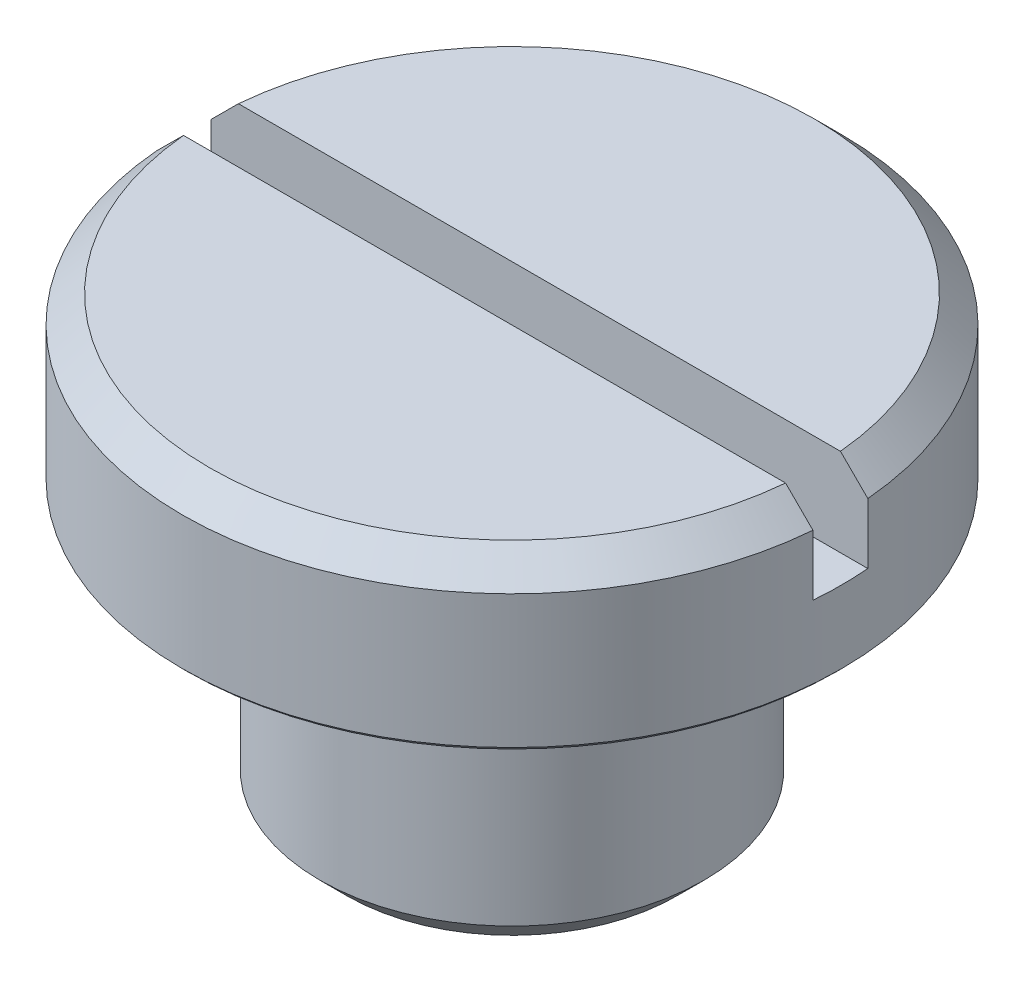
ISO-10303-21;
HEADER;
FILE_DESCRIPTION(('STEP AP214'),'2;1');
FILE_NAME('part.step','',(''),(''),'','','');
FILE_SCHEMA(('AUTOMOTIVE_DESIGN { 1 0 10303 214 1 1 1 1 }'));
ENDSEC;
DATA;
#1=APPLICATION_CONTEXT('core data for automotive mechanical design processes');
#2=APPLICATION_PROTOCOL_DEFINITION('international standard','automotive_design',2000,#1);
#3=PRODUCT_CONTEXT('',#1,'mechanical');
#4=PRODUCT('Part','Part','',(#3));
#5=PRODUCT_RELATED_PRODUCT_CATEGORY('part','',(#4));
#6=PRODUCT_DEFINITION_FORMATION('','',#4);
#7=PRODUCT_DEFINITION_CONTEXT('part definition',#1,'design');
#8=PRODUCT_DEFINITION('design','',#6,#7);
#9=PRODUCT_DEFINITION_SHAPE('','',#8);
#10=(LENGTH_UNIT() NAMED_UNIT(*) SI_UNIT(.MILLI.,.METRE.));
#11=(NAMED_UNIT(*) PLANE_ANGLE_UNIT() SI_UNIT($,.RADIAN.));
#12=(NAMED_UNIT(*) SI_UNIT($,.STERADIAN.) SOLID_ANGLE_UNIT());
#13=UNCERTAINTY_MEASURE_WITH_UNIT(LENGTH_MEASURE(1.E-05),#10,'distance_accuracy_value','');
#14=(GEOMETRIC_REPRESENTATION_CONTEXT(3) GLOBAL_UNCERTAINTY_ASSIGNED_CONTEXT((#13)) GLOBAL_UNIT_ASSIGNED_CONTEXT((#10,
#11,#12)) REPRESENTATION_CONTEXT('',''));
#15=CARTESIAN_POINT('',(0.,0.,0.));
#16=DIRECTION('',(0.,0.,1.));
#17=DIRECTION('',(1.,0.,0.));
#18=AXIS2_PLACEMENT_3D('',#15,#16,#17);
#19=CARTESIAN_POINT('',(0.,0.,-5.55625));
#20=DIRECTION('',(0.,-1.,0.));
#21=DIRECTION('',(0.,0.,-1.));
#22=AXIS2_PLACEMENT_3D('',#19,#20,#21);
#23=PLANE('',#22);
#24=CARTESIAN_POINT('',(0.,5.68433104405908E-11,0.));
#25=DIRECTION('',(0.,1.,0.));
#26=DIRECTION('',(0.,0.,1.));
#27=AXIS2_PLACEMENT_3D('',#24,#25,#26);
#28=CIRCLE('',#27,4.76885000000493);
#29=CARTESIAN_POINT('',(0.,5.68433104405908E-11,4.76885000000493));
#30=VERTEX_POINT('',#29);
#31=EDGE_CURVE('E372',#30,#30,#28,.T.);
#32=ORIENTED_EDGE('',*,*,#31,.F.);
#33=EDGE_LOOP('',(#32));
#34=FACE_BOUND('',#33,.T.);
#35=ADVANCED_FACE('F16',(#34),#23,.T.);
#36=CARTESIAN_POINT('',(0.,0.787399999978788,0.));
#37=DIRECTION('',(0.,1.,0.));
#38=DIRECTION('',(0.,0.,1.));
#39=AXIS2_PLACEMENT_3D('',#36,#37,#38);
#40=CONICAL_SURFACE('',#39,5.55624999998372,0.785398163433544);
#41=ORIENTED_EDGE('',*,*,#31,.T.);
#42=EDGE_LOOP('',(#41));
#43=FACE_BOUND('',#42,.T.);
#44=CARTESIAN_POINT('',(0.,0.787400000000008,0.));
#45=DIRECTION('',(0.,-1.,0.));
#46=DIRECTION('',(0.,0.,-1.));
#47=AXIS2_PLACEMENT_3D('',#44,#45,#46);
#48=CIRCLE('',#47,5.55625);
#49=CARTESIAN_POINT('',(0.,0.787400000000008,-5.55625));
#50=VERTEX_POINT('',#49);
#51=EDGE_CURVE('E369',#50,#50,#48,.F.);
#52=ORIENTED_EDGE('',*,*,#51,.F.);
#53=EDGE_LOOP('',(#52));
#54=FACE_BOUND('',#53,.T.);
#55=ADVANCED_FACE('F595',(#43,#54),#40,.T.);
#56=CARTESIAN_POINT('',(0.,0.,0.));
#57=DIRECTION('',(0.,-1.,0.));
#58=DIRECTION('',(0.,0.,-1.));
#59=AXIS2_PLACEMENT_3D('',#56,#57,#58);
#60=CYLINDRICAL_SURFACE('',#59,5.55625);
#61=CARTESIAN_POINT('',(0.,6.35,0.));
#62=DIRECTION('',(0.,-1.,0.));
#63=DIRECTION('',(0.,0.,-1.));
#64=AXIS2_PLACEMENT_3D('',#61,#62,#63);
#65=CIRCLE('',#64,5.55625);
#66=CARTESIAN_POINT('',(0.,6.35,-5.55625));
#67=VERTEX_POINT('',#66);
#68=EDGE_CURVE('E361',#67,#67,#65,.T.);
#69=ORIENTED_EDGE('',*,*,#68,.T.);
#70=EDGE_LOOP('',(#69));
#71=FACE_BOUND('',#70,.T.);
#72=ORIENTED_EDGE('',*,*,#51,.T.);
#73=EDGE_LOOP('',(#72));
#74=FACE_BOUND('',#73,.T.);
#75=ADVANCED_FACE('F355',(#71,#74),#60,.T.);
#76=CARTESIAN_POINT('',(0.,7.14375,0.));
#77=DIRECTION('',(0.,-1.,0.));
#78=DIRECTION('',(0.,0.,-1.));
#79=AXIS2_PLACEMENT_3D('',#76,#77,#78);
#80=TOROIDAL_SURFACE('',#79,5.55625,0.793750000000001);
#81=ORIENTED_EDGE('',*,*,#68,.F.);
#82=EDGE_LOOP('',(#81));
#83=FACE_BOUND('',#82,.T.);
#84=CARTESIAN_POINT('',(0.,7.9375,0.));
#85=DIRECTION('',(0.,-1.,0.));
#86=DIRECTION('',(0.,0.,1.));
#87=AXIS2_PLACEMENT_3D('',#84,#85,#86);
#88=CIRCLE('',#87,5.55625);
#89=CARTESIAN_POINT('',(0.,7.9375,-5.55625));
#90=VERTEX_POINT('',#89);
#91=CARTESIAN_POINT('',(0.,7.9375,5.55625));
#92=VERTEX_POINT('',#91);
#93=EDGE_CURVE('E331',#90,#92,#88,.F.);
#94=ORIENTED_EDGE('',*,*,#93,.F.);
#95=CARTESIAN_POINT('',(0.,7.9375,0.));
#96=DIRECTION('',(0.,-1.,0.));
#97=DIRECTION('',(0.,0.,-1.));
#98=AXIS2_PLACEMENT_3D('',#95,#96,#97);
#99=CIRCLE('',#98,5.55625);
#100=EDGE_CURVE('E321',#92,#90,#99,.F.);
#101=ORIENTED_EDGE('',*,*,#100,.F.);
#102=EDGE_LOOP('',(#94,#101));
#103=FACE_BOUND('',#102,.T.);
#104=ADVANCED_FACE('F351',(#83,#103),#80,.F.);
#105=CARTESIAN_POINT('',(0.,7.9375,-6.604));
#106=DIRECTION('',(0.,-1.,0.));
#107=DIRECTION('',(0.,0.,-1.));
#108=AXIS2_PLACEMENT_3D('',#105,#106,#107);
#109=PLANE('',#108);
#110=ORIENTED_EDGE('',*,*,#100,.T.);
#111=ORIENTED_EDGE('',*,*,#93,.T.);
#112=EDGE_LOOP('',(#110,#111));
#113=FACE_BOUND('',#112,.T.);
#114=CARTESIAN_POINT('',(0.,7.9375,0.));
#115=DIRECTION('',(0.,1.,0.));
#116=DIRECTION('',(0.,0.,1.));
#117=AXIS2_PLACEMENT_3D('',#114,#115,#116);
#118=CIRCLE('',#117,6.477);
#119=CARTESIAN_POINT('',(0.,7.9375,6.477));
#120=VERTEX_POINT('',#119);
#121=CARTESIAN_POINT('',(0.,7.9375,-6.477));
#122=VERTEX_POINT('',#121);
#123=EDGE_CURVE('E299',#120,#122,#118,.T.);
#124=ORIENTED_EDGE('',*,*,#123,.F.);
#125=CARTESIAN_POINT('',(0.,7.9375,0.));
#126=DIRECTION('',(0.,1.,0.));
#127=DIRECTION('',(0.,0.,-1.));
#128=AXIS2_PLACEMENT_3D('',#125,#126,#127);
#129=CIRCLE('',#128,6.477);
#130=EDGE_CURVE('E275',#122,#120,#129,.T.);
#131=ORIENTED_EDGE('',*,*,#130,.F.);
#132=EDGE_LOOP('',(#124,#131));
#133=FACE_BOUND('',#132,.T.);
#134=ADVANCED_FACE('F289',(#113,#133),#109,.T.);
#135=CARTESIAN_POINT('',(0.,8.0645,0.));
#136=DIRECTION('',(0.,-1.,0.));
#137=DIRECTION('',(0.,0.,-1.));
#138=AXIS2_PLACEMENT_3D('',#135,#136,#137);
#139=TOROIDAL_SURFACE('',#138,6.477,0.127);
#140=ORIENTED_EDGE('',*,*,#130,.T.);
#141=ORIENTED_EDGE('',*,*,#123,.T.);
#142=EDGE_LOOP('',(#140,#141));
#143=FACE_BOUND('',#142,.T.);
#144=CARTESIAN_POINT('',(0.,8.0645,0.));
#145=DIRECTION('',(0.,-1.,0.));
#146=DIRECTION('',(0.,0.,-1.));
#147=AXIS2_PLACEMENT_3D('',#144,#145,#146);
#148=CIRCLE('',#147,6.604);
#149=CARTESIAN_POINT('',(0.,8.0645,-6.604));
#150=VERTEX_POINT('',#149);
#151=EDGE_CURVE('E296',#150,#150,#148,.F.);
#152=ORIENTED_EDGE('',*,*,#151,.F.);
#153=EDGE_LOOP('',(#152));
#154=FACE_BOUND('',#153,.T.);
#155=ADVANCED_FACE('F279',(#143,#154),#139,.T.);
#156=CARTESIAN_POINT('',(0.,0.,0.));
#157=DIRECTION('',(0.,-1.,0.));
#158=DIRECTION('',(0.,0.,-1.));
#159=AXIS2_PLACEMENT_3D('',#156,#157,#158);
#160=CYLINDRICAL_SURFACE('',#159,6.604);
#161=ORIENTED_EDGE('',*,*,#151,.T.);
#162=EDGE_LOOP('',(#161));
#163=FACE_BOUND('',#162,.T.);
#164=CARTESIAN_POINT('',(0.,8.8265,0.));
#165=DIRECTION('',(0.,-1.,0.));
#166=DIRECTION('',(0.,0.,-1.));
#167=AXIS2_PLACEMENT_3D('',#164,#165,#166);
#168=CIRCLE('',#167,6.604);
#169=CARTESIAN_POINT('',(0.,8.8265,-6.604));
#170=VERTEX_POINT('',#169);
#171=EDGE_CURVE('E638',#170,#170,#168,.T.);
#172=ORIENTED_EDGE('',*,*,#171,.T.);
#173=EDGE_LOOP('',(#172));
#174=FACE_BOUND('',#173,.T.);
#175=ADVANCED_FACE('F257',(#163,#174),#160,.T.);
#176=CARTESIAN_POINT('',(0.,8.8265,0.));
#177=DIRECTION('',(0.,-1.,0.));
#178=DIRECTION('',(0.,0.,-1.));
#179=AXIS2_PLACEMENT_3D('',#176,#177,#178);
#180=TOROIDAL_SURFACE('',#179,6.985,0.381);
#181=ORIENTED_EDGE('',*,*,#171,.F.);
#182=EDGE_LOOP('',(#181));
#183=FACE_BOUND('',#182,.T.);
#184=CARTESIAN_POINT('',(0.,9.2075,0.));
#185=DIRECTION('',(0.,-1.,0.));
#186=DIRECTION('',(0.,0.,1.));
#187=AXIS2_PLACEMENT_3D('',#184,#185,#186);
#188=CIRCLE('',#187,6.985);
#189=CARTESIAN_POINT('',(0.,9.2075,-6.985));
#190=VERTEX_POINT('',#189);
#191=CARTESIAN_POINT('',(0.,9.2075,6.985));
#192=VERTEX_POINT('',#191);
#193=EDGE_CURVE('E203',#190,#192,#188,.F.);
#194=ORIENTED_EDGE('',*,*,#193,.F.);
#195=CARTESIAN_POINT('',(0.,9.2075,0.));
#196=DIRECTION('',(0.,-1.,0.));
#197=DIRECTION('',(0.,0.,-1.));
#198=AXIS2_PLACEMENT_3D('',#195,#196,#197);
#199=CIRCLE('',#198,6.985);
#200=EDGE_CURVE('E213',#192,#190,#199,.F.);
#201=ORIENTED_EDGE('',*,*,#200,.F.);
#202=EDGE_LOOP('',(#194,#201));
#203=FACE_BOUND('',#202,.T.);
#204=ADVANCED_FACE('F253',(#183,#203),#180,.F.);
#205=CARTESIAN_POINT('',(0.,9.2075,-8.763));
#206=DIRECTION('',(0.,-1.,0.));
#207=DIRECTION('',(0.,0.,-1.));
#208=AXIS2_PLACEMENT_3D('',#205,#206,#207);
#209=PLANE('',#208);
#210=CARTESIAN_POINT('',(0.,9.2075,0.));
#211=DIRECTION('',(0.,1.,0.));
#212=DIRECTION('',(0.,0.,1.));
#213=AXIS2_PLACEMENT_3D('',#210,#211,#212);
#214=CIRCLE('',#213,8.382);
#215=CARTESIAN_POINT('',(0.,9.2075,-8.382));
#216=VERTEX_POINT('',#215);
#217=CARTESIAN_POINT('',(0.,9.2075,8.382));
#218=VERTEX_POINT('',#217);
#219=EDGE_CURVE('E224',#216,#218,#214,.F.);
#220=ORIENTED_EDGE('',*,*,#219,.T.);
#221=CARTESIAN_POINT('',(0.,9.2075,0.));
#222=DIRECTION('',(0.,1.,0.));
#223=DIRECTION('',(0.,0.,-1.));
#224=AXIS2_PLACEMENT_3D('',#221,#222,#223);
#225=CIRCLE('',#224,8.382);
#226=EDGE_CURVE('E175',#218,#216,#225,.F.);
#227=ORIENTED_EDGE('',*,*,#226,.T.);
#228=EDGE_LOOP('',(#220,#227));
#229=FACE_BOUND('',#228,.T.);
#230=ORIENTED_EDGE('',*,*,#193,.T.);
#231=ORIENTED_EDGE('',*,*,#200,.T.);
#232=EDGE_LOOP('',(#230,#231));
#233=FACE_BOUND('',#232,.T.);
#234=ADVANCED_FACE('F190',(#229,#233),#209,.T.);
#235=CARTESIAN_POINT('',(0.,8.8265,0.));
#236=DIRECTION('',(0.,-1.,0.));
#237=DIRECTION('',(0.,0.,-1.));
#238=AXIS2_PLACEMENT_3D('',#235,#236,#237);
#239=TOROIDAL_SURFACE('',#238,8.382,0.381);
#240=ORIENTED_EDGE('',*,*,#219,.F.);
#241=ORIENTED_EDGE('',*,*,#226,.F.);
#242=EDGE_LOOP('',(#240,#241));
#243=FACE_BOUND('',#242,.T.);
#244=CARTESIAN_POINT('',(0.,8.8265,0.));
#245=DIRECTION('',(0.,-1.,0.));
#246=DIRECTION('',(0.,0.,-1.));
#247=AXIS2_PLACEMENT_3D('',#244,#245,#246);
#248=CIRCLE('',#247,8.763);
#249=CARTESIAN_POINT('',(0.,8.8265,-8.763));
#250=VERTEX_POINT('',#249);
#251=EDGE_CURVE('E198',#250,#250,#248,.T.);
#252=ORIENTED_EDGE('',*,*,#251,.T.);
#253=EDGE_LOOP('',(#252));
#254=FACE_BOUND('',#253,.T.);
#255=ADVANCED_FACE('F180',(#243,#254),#239,.F.);
#256=CARTESIAN_POINT('',(0.,0.,0.));
#257=DIRECTION('',(0.,-1.,0.));
#258=DIRECTION('',(0.,0.,-1.));
#259=AXIS2_PLACEMENT_3D('',#256,#257,#258);
#260=CYLINDRICAL_SURFACE('',#259,8.763);
#261=ORIENTED_EDGE('',*,*,#251,.F.);
#262=EDGE_LOOP('',(#261));
#263=FACE_BOUND('',#262,.T.);
#264=CARTESIAN_POINT('',(0.,8.0645,0.));
#265=DIRECTION('',(0.,-1.,0.));
#266=DIRECTION('',(0.,0.,-1.));
#267=AXIS2_PLACEMENT_3D('',#264,#265,#266);
#268=CIRCLE('',#267,8.763);
#269=CARTESIAN_POINT('',(0.,8.0645,-8.763));
#270=VERTEX_POINT('',#269);
#271=EDGE_CURVE('E124',#270,#270,#268,.F.);
#272=ORIENTED_EDGE('',*,*,#271,.F.);
#273=EDGE_LOOP('',(#272));
#274=FACE_BOUND('',#273,.T.);
#275=ADVANCED_FACE('F155',(#263,#274),#260,.F.);
#276=CARTESIAN_POINT('',(0.,8.0645,0.));
#277=DIRECTION('',(0.,-1.,0.));
#278=DIRECTION('',(0.,0.,-1.));
#279=AXIS2_PLACEMENT_3D('',#276,#277,#278);
#280=TOROIDAL_SURFACE('',#279,8.89,0.127);
#281=ORIENTED_EDGE('',*,*,#271,.T.);
#282=EDGE_LOOP('',(#281));
#283=FACE_BOUND('',#282,.T.);
#284=CARTESIAN_POINT('',(0.,7.9375,0.));
#285=DIRECTION('',(0.,-1.,0.));
#286=DIRECTION('',(0.,0.,-1.));
#287=AXIS2_PLACEMENT_3D('',#284,#285,#286);
#288=CIRCLE('',#287,8.89);
#289=CARTESIAN_POINT('',(0.,7.9375,8.89));
#290=VERTEX_POINT('',#289);
#291=CARTESIAN_POINT('',(0.,7.9375,-8.89));
#292=VERTEX_POINT('',#291);
#293=EDGE_CURVE('E120',#290,#292,#288,.F.);
#294=ORIENTED_EDGE('',*,*,#293,.F.);
#295=CARTESIAN_POINT('',(0.,7.9375,0.));
#296=DIRECTION('',(0.,-1.,0.));
#297=DIRECTION('',(0.,0.,1.));
#298=AXIS2_PLACEMENT_3D('',#295,#296,#297);
#299=CIRCLE('',#298,8.89);
#300=EDGE_CURVE('E116',#292,#290,#299,.F.);
#301=ORIENTED_EDGE('',*,*,#300,.F.);
#302=EDGE_LOOP('',(#294,#301));
#303=FACE_BOUND('',#302,.T.);
#304=ADVANCED_FACE('F119',(#283,#303),#280,.T.);
#305=CARTESIAN_POINT('',(0.,7.9375,-9.525));
#306=DIRECTION('',(0.,-1.,0.));
#307=DIRECTION('',(0.,0.,-1.));
#308=AXIS2_PLACEMENT_3D('',#305,#306,#307);
#309=PLANE('',#308);
#310=ORIENTED_EDGE('',*,*,#300,.T.);
#311=ORIENTED_EDGE('',*,*,#293,.T.);
#312=EDGE_LOOP('',(#310,#311));
#313=FACE_BOUND('',#312,.T.);
#314=CARTESIAN_POINT('',(0.,7.9375,0.));
#315=DIRECTION('',(0.,1.,0.));
#316=DIRECTION('',(0.,0.,1.));
#317=AXIS2_PLACEMENT_3D('',#314,#315,#316);
#318=CIRCLE('',#317,9.39800000000001);
#319=CARTESIAN_POINT('',(0.,7.9375,9.39800000000001));
#320=VERTEX_POINT('',#319);
#321=EDGE_CURVE('E466',#320,#320,#318,.T.);
#322=ORIENTED_EDGE('',*,*,#321,.F.);
#323=EDGE_LOOP('',(#322));
#324=FACE_BOUND('',#323,.T.);
#325=ADVANCED_FACE('F128',(#313,#324),#309,.T.);
#326=CARTESIAN_POINT('',(0.,12.7,0.));
#327=DIRECTION('',(0.,1.,0.));
#328=DIRECTION('',(0.,0.,1.));
#329=AXIS2_PLACEMENT_3D('',#326,#327,#328);
#330=PLANE('',#329);
#331=CARTESIAN_POINT('',(0.,12.7,0.));
#332=DIRECTION('',(0.,-1.,0.));
#333=DIRECTION('',(1.,0.,0.));
#334=AXIS2_PLACEMENT_3D('',#331,#332,#333);
#335=CIRCLE('',#334,8.73759999999999);
#336=CARTESIAN_POINT('',(-8.70147198452652,12.7,-0.79375));
#337=VERTEX_POINT('',#336);
#338=CARTESIAN_POINT('',(8.70147198452652,12.7,-0.79375));
#339=VERTEX_POINT('',#338);
#340=EDGE_CURVE('E441',#337,#339,#335,.T.);
#341=ORIENTED_EDGE('',*,*,#340,.F.);
#342=DIRECTION('',(-1.,0.,0.));
#343=VECTOR('',#342,1.);
#344=CARTESIAN_POINT('',(-11.6601748807631,12.7,-0.79375));
#345=LINE('',#344,#343);
#346=EDGE_CURVE('E80',#337,#339,#345,.F.);
#347=ORIENTED_EDGE('',*,*,#346,.T.);
#348=EDGE_LOOP('',(#341,#347));
#349=FACE_BOUND('',#348,.T.);
#350=ADVANCED_FACE('F149',(#349),#330,.T.);
#351=CARTESIAN_POINT('',(-11.6601748807631,10.16,0.79375));
#352=DIRECTION('',(0.,1.,0.));
#353=DIRECTION('',(0.,0.,1.));
#354=AXIS2_PLACEMENT_3D('',#351,#352,#353);
#355=PLANE('',#354);
#356=DIRECTION('',(-1.,0.,0.));
#357=VECTOR('',#356,1.);
#358=CARTESIAN_POINT('',(-11.6601748807631,10.16,-0.79375));
#359=LINE('',#358,#357);
#360=CARTESIAN_POINT('',(9.49186946483674,10.16,-0.79375));
#361=VERTEX_POINT('',#360);
#362=CARTESIAN_POINT('',(-9.49186946483674,10.16,-0.79375));
#363=VERTEX_POINT('',#362);
#364=EDGE_CURVE('E59',#361,#363,#359,.T.);
#365=ORIENTED_EDGE('',*,*,#364,.T.);
#366=CARTESIAN_POINT('',(0.,10.16,0.));
#367=DIRECTION('',(0.,-1.,0.));
#368=DIRECTION('',(0.,0.,-1.));
#369=AXIS2_PLACEMENT_3D('',#366,#367,#368);
#370=CIRCLE('',#369,9.525);
#371=CARTESIAN_POINT('',(-9.49186946483674,10.16,0.79375));
#372=VERTEX_POINT('',#371);
#373=EDGE_CURVE('E75',#372,#363,#370,.T.);
#374=ORIENTED_EDGE('',*,*,#373,.F.);
#375=DIRECTION('',(1.,0.,0.));
#376=VECTOR('',#375,1.);
#377=CARTESIAN_POINT('',(-11.6601748807631,10.16,0.79375));
#378=LINE('',#377,#376);
#379=CARTESIAN_POINT('',(9.49186946483674,10.16,0.79375));
#380=VERTEX_POINT('',#379);
#381=EDGE_CURVE('E432',#372,#380,#378,.T.);
#382=ORIENTED_EDGE('',*,*,#381,.T.);
#383=CARTESIAN_POINT('',(0.,10.16,0.));
#384=DIRECTION('',(0.,-1.,0.));
#385=DIRECTION('',(0.,0.,-1.));
#386=AXIS2_PLACEMENT_3D('',#383,#384,#385);
#387=CIRCLE('',#386,9.525);
#388=EDGE_CURVE('E35',#380,#361,#387,.F.);
#389=ORIENTED_EDGE('',*,*,#388,.T.);
#390=EDGE_LOOP('',(#365,#374,#382,#389));
#391=FACE_BOUND('',#390,.T.);
#392=ADVANCED_FACE('F405',(#391),#355,.T.);
#393=CARTESIAN_POINT('',(0.,12.7,0.));
#394=DIRECTION('',(0.,1.,0.));
#395=DIRECTION('',(0.,0.,1.));
#396=AXIS2_PLACEMENT_3D('',#393,#394,#395);
#397=PLANE('',#396);
#398=DIRECTION('',(1.,0.,0.));
#399=VECTOR('',#398,1.);
#400=CARTESIAN_POINT('',(-11.6601748807631,12.7,0.79375));
#401=LINE('',#400,#399);
#402=CARTESIAN_POINT('',(8.70147198452652,12.7,0.79375));
#403=VERTEX_POINT('',#402);
#404=CARTESIAN_POINT('',(-8.70147198452652,12.7,0.79375));
#405=VERTEX_POINT('',#404);
#406=EDGE_CURVE('E383',#403,#405,#401,.F.);
#407=ORIENTED_EDGE('',*,*,#406,.T.);
#408=CARTESIAN_POINT('',(0.,12.7,0.));
#409=DIRECTION('',(0.,-1.,0.));
#410=DIRECTION('',(1.,0.,0.));
#411=AXIS2_PLACEMENT_3D('',#408,#409,#410);
#412=CIRCLE('',#411,8.73759999999999);
#413=EDGE_CURVE('E72',#403,#405,#412,.T.);
#414=ORIENTED_EDGE('',*,*,#413,.F.);
#415=EDGE_LOOP('',(#407,#414));
#416=FACE_BOUND('',#415,.T.);
#417=ADVANCED_FACE('F400',(#416),#397,.T.);
#418=CARTESIAN_POINT('',(0.,11.9126,0.));
#419=DIRECTION('',(0.,-1.,0.));
#420=DIRECTION('',(1.,0.,0.));
#421=AXIS2_PLACEMENT_3D('',#418,#419,#420);
#422=CONICAL_SURFACE('',#421,9.525,0.785398163397453);
#423=CARTESIAN_POINT('',(9.49186946483674,11.9126,0.79375));
#424=CARTESIAN_POINT('',(9.36015813194599,12.0438549959036,0.79375));
#425=CARTESIAN_POINT('',(9.22843600882729,12.175099160503,0.79375));
#426=CARTESIAN_POINT('',(8.96497018205723,12.4375658271696,0.79375));
#427=CARTESIAN_POINT('',(8.83322647840585,12.568788329237,0.79375));
#428=CARTESIAN_POINT('',(8.70147198452652,12.7,0.79375));
#429=B_SPLINE_CURVE_WITH_KNOTS('',3,(#423,#424,#425,#426,#427,#428),.UNSPECIFIED.,.F.,.F.,(4,2,
4),(0.,0.557836657223684,1.11567331477257),.UNSPECIFIED.);
#430=CARTESIAN_POINT('',(9.49186946483674,11.9126,0.79375));
#431=VERTEX_POINT('',#430);
#432=EDGE_CURVE('E384',#431,#403,#429,.T.);
#433=ORIENTED_EDGE('',*,*,#432,.T.);
#434=ORIENTED_EDGE('',*,*,#413,.T.);
#435=CARTESIAN_POINT('',(-8.70147198452652,12.7,0.79375));
#436=CARTESIAN_POINT('',(-8.83322647840585,12.568788329237,0.79375));
#437=CARTESIAN_POINT('',(-8.96497018205723,12.4375658271696,0.79375));
#438=CARTESIAN_POINT('',(-9.22843600882729,12.175099160503,0.79375));
#439=CARTESIAN_POINT('',(-9.36015813194599,12.0438549959036,0.79375));
#440=CARTESIAN_POINT('',(-9.49186946483674,11.9126,0.79375));
#441=B_SPLINE_CURVE_WITH_KNOTS('',3,(#435,#436,#437,#438,#439,#440),.UNSPECIFIED.,.F.,.F.,(4,2,
4),(0.,0.557836657548883,1.11567331477257),.UNSPECIFIED.);
#442=CARTESIAN_POINT('',(-9.49186946483674,11.9126,0.79375));
#443=VERTEX_POINT('',#442);
#444=EDGE_CURVE('E373',#405,#443,#441,.T.);
#445=ORIENTED_EDGE('',*,*,#444,.T.);
#446=CARTESIAN_POINT('',(0.,11.9126,0.));
#447=DIRECTION('',(0.,-1.,0.));
#448=DIRECTION('',(0.,0.,-1.));
#449=AXIS2_PLACEMENT_3D('',#446,#447,#448);
#450=CIRCLE('',#449,9.525);
#451=EDGE_CURVE('E423',#431,#443,#450,.T.);
#452=ORIENTED_EDGE('',*,*,#451,.F.);
#453=EDGE_LOOP('',(#433,#434,#445,#452));
#454=FACE_BOUND('',#453,.T.);
#455=ADVANCED_FACE('F394',(#454),#422,.T.);
#456=CARTESIAN_POINT('',(0.,8.06449999999999,0.));
#457=DIRECTION('',(0.,1.,0.));
#458=DIRECTION('',(0.,0.,1.));
#459=AXIS2_PLACEMENT_3D('',#456,#457,#458);
#460=CONICAL_SURFACE('',#459,9.525,0.785398163397448);
#461=CARTESIAN_POINT('',(0.,8.06449999999999,0.));
#462=DIRECTION('',(0.,-1.,0.));
#463=DIRECTION('',(0.,0.,-1.));
#464=AXIS2_PLACEMENT_3D('',#461,#462,#463);
#465=CIRCLE('',#464,9.525);
#466=CARTESIAN_POINT('',(0.,8.06449999999999,-9.525));
#467=VERTEX_POINT('',#466);
#468=EDGE_CURVE('E421',#467,#467,#465,.F.);
#469=ORIENTED_EDGE('',*,*,#468,.F.);
#470=EDGE_LOOP('',(#469));
#471=FACE_BOUND('',#470,.T.);
#472=ORIENTED_EDGE('',*,*,#321,.T.);
#473=EDGE_LOOP('',(#472));
#474=FACE_BOUND('',#473,.T.);
#475=ADVANCED_FACE('F399',(#471,#474),#460,.T.);
#476=CARTESIAN_POINT('',(0.,11.9126,0.));
#477=DIRECTION('',(0.,-1.,0.));
#478=DIRECTION('',(1.,0.,0.));
#479=AXIS2_PLACEMENT_3D('',#476,#477,#478);
#480=CONICAL_SURFACE('',#479,9.525,0.785398163397453);
#481=CARTESIAN_POINT('',(8.70147198452652,12.7,-0.79375));
#482=CARTESIAN_POINT('',(8.83322647840585,12.568788329237,-0.79375));
#483=CARTESIAN_POINT('',(8.96497018205723,12.4375658271696,-0.79375));
#484=CARTESIAN_POINT('',(9.22843600882729,12.175099160503,-0.79375));
#485=CARTESIAN_POINT('',(9.36015813194598,12.0438549959036,-0.79375));
#486=CARTESIAN_POINT('',(9.49186946483674,11.9126,-0.79375));
#487=B_SPLINE_CURVE_WITH_KNOTS('',3,(#481,#482,#483,#484,#485,#486),.UNSPECIFIED.,.F.,.F.,(4,2,
4),(0.,0.557836657548882,1.11567331477257),.UNSPECIFIED.);
#488=CARTESIAN_POINT('',(9.49186946483674,11.9126,-0.79375));
#489=VERTEX_POINT('',#488);
#490=EDGE_CURVE('E434',#339,#489,#487,.T.);
#491=ORIENTED_EDGE('',*,*,#490,.T.);
#492=CARTESIAN_POINT('',(0.,11.9126,0.));
#493=DIRECTION('',(0.,-1.,0.));
#494=DIRECTION('',(0.,0.,-1.));
#495=AXIS2_PLACEMENT_3D('',#492,#493,#494);
#496=CIRCLE('',#495,9.525);
#497=CARTESIAN_POINT('',(-9.49186946483674,11.9126,-0.79375));
#498=VERTEX_POINT('',#497);
#499=EDGE_CURVE('E49',#498,#489,#496,.T.);
#500=ORIENTED_EDGE('',*,*,#499,.F.);
#501=CARTESIAN_POINT('',(-9.49186946483674,11.9126,-0.79375));
#502=CARTESIAN_POINT('',(-9.36015813194599,12.0438549959036,-0.79375));
#503=CARTESIAN_POINT('',(-9.22843600882729,12.175099160503,-0.79375));
#504=CARTESIAN_POINT('',(-8.96497018205723,12.4375658271696,-0.79375));
#505=CARTESIAN_POINT('',(-8.83322647840585,12.568788329237,-0.79375));
#506=CARTESIAN_POINT('',(-8.70147198452652,12.7,-0.79375));
#507=B_SPLINE_CURVE_WITH_KNOTS('',3,(#501,#502,#503,#504,#505,#506),.UNSPECIFIED.,.F.,.F.,(4,2,
4),(0.,0.557836657223685,1.11567331477257),.UNSPECIFIED.);
#508=EDGE_CURVE('E130',#498,#337,#507,.T.);
#509=ORIENTED_EDGE('',*,*,#508,.T.);
#510=ORIENTED_EDGE('',*,*,#340,.T.);
#511=EDGE_LOOP('',(#491,#500,#509,#510));
#512=FACE_BOUND('',#511,.T.);
#513=ADVANCED_FACE('F455',(#512),#480,.T.);
#514=CARTESIAN_POINT('',(-11.6601748807631,10.16,-0.79375));
#515=DIRECTION('',(0.,0.,-1.));
#516=DIRECTION('',(-1.,0.,0.));
#517=AXIS2_PLACEMENT_3D('',#514,#515,#516);
#518=PLANE('',#517);
#519=ORIENTED_EDGE('',*,*,#490,.F.);
#520=ORIENTED_EDGE('',*,*,#346,.F.);
#521=ORIENTED_EDGE('',*,*,#508,.F.);
#522=DIRECTION('',(0.,1.,0.));
#523=VECTOR('',#522,1.);
#524=CARTESIAN_POINT('',(-9.49186946483674,10.16,-0.79375));
#525=LINE('',#524,#523);
#526=EDGE_CURVE('E436',#363,#498,#525,.T.);
#527=ORIENTED_EDGE('',*,*,#526,.F.);
#528=ORIENTED_EDGE('',*,*,#364,.F.);
#529=DIRECTION('',(0.,-1.,0.));
#530=VECTOR('',#529,1.);
#531=CARTESIAN_POINT('',(9.49186946483674,0.,-0.793750000000001));
#532=LINE('',#531,#530);
#533=EDGE_CURVE('E27',#489,#361,#532,.T.);
#534=ORIENTED_EDGE('',*,*,#533,.F.);
#535=EDGE_LOOP('',(#519,#520,#521,#527,#528,#534));
#536=FACE_BOUND('',#535,.T.);
#537=ADVANCED_FACE('F417',(#536),#518,.F.);
#538=CARTESIAN_POINT('',(-11.6601748807631,10.16,0.79375));
#539=DIRECTION('',(0.,0.,1.));
#540=DIRECTION('',(1.,0.,0.));
#541=AXIS2_PLACEMENT_3D('',#538,#539,#540);
#542=PLANE('',#541);
#543=ORIENTED_EDGE('',*,*,#444,.F.);
#544=ORIENTED_EDGE('',*,*,#406,.F.);
#545=ORIENTED_EDGE('',*,*,#432,.F.);
#546=DIRECTION('',(0.,-1.,0.));
#547=VECTOR('',#546,1.);
#548=CARTESIAN_POINT('',(9.49186946483674,0.,0.79375));
#549=LINE('',#548,#547);
#550=EDGE_CURVE('E11',#380,#431,#549,.F.);
#551=ORIENTED_EDGE('',*,*,#550,.F.);
#552=ORIENTED_EDGE('',*,*,#381,.F.);
#553=DIRECTION('',(0.,1.,0.));
#554=VECTOR('',#553,1.);
#555=CARTESIAN_POINT('',(-9.49186946483674,10.16,0.79375));
#556=LINE('',#555,#554);
#557=EDGE_CURVE('E382',#443,#372,#556,.F.);
#558=ORIENTED_EDGE('',*,*,#557,.F.);
#559=EDGE_LOOP('',(#543,#544,#545,#551,#552,#558));
#560=FACE_BOUND('',#559,.T.);
#561=ADVANCED_FACE('F390',(#560),#542,.F.);
#562=CARTESIAN_POINT('',(0.,0.,0.));
#563=DIRECTION('',(0.,-1.,0.));
#564=DIRECTION('',(0.,0.,-1.));
#565=AXIS2_PLACEMENT_3D('',#562,#563,#564);
#566=CYLINDRICAL_SURFACE('',#565,9.525);
#567=ORIENTED_EDGE('',*,*,#468,.T.);
#568=EDGE_LOOP('',(#567));
#569=FACE_BOUND('',#568,.T.);
#570=ORIENTED_EDGE('',*,*,#388,.F.);
#571=ORIENTED_EDGE('',*,*,#550,.T.);
#572=ORIENTED_EDGE('',*,*,#451,.T.);
#573=ORIENTED_EDGE('',*,*,#557,.T.);
#574=ORIENTED_EDGE('',*,*,#373,.T.);
#575=ORIENTED_EDGE('',*,*,#526,.T.);
#576=ORIENTED_EDGE('',*,*,#499,.T.);
#577=ORIENTED_EDGE('',*,*,#533,.T.);
#578=EDGE_LOOP('',(#570,#571,#572,#573,#574,#575,#576,#577));
#579=FACE_BOUND('',#578,.T.);
#580=ADVANCED_FACE('F411',(#569,#579),#566,.T.);
#581=CLOSED_SHELL('',(#35,#55,#75,#104,#134,#155,#175,#204,#234,#255,#275,#304,#325,#350,#392,
#417,#455,#475,#513,#537,#561,#580));
#582=MANIFOLD_SOLID_BREP('B1',#581);
#583=ADVANCED_BREP_SHAPE_REPRESENTATION('',(#18,#582),#14);
#584=SHAPE_DEFINITION_REPRESENTATION(#9,#583);
ENDSEC;
END-ISO-10303-21;
